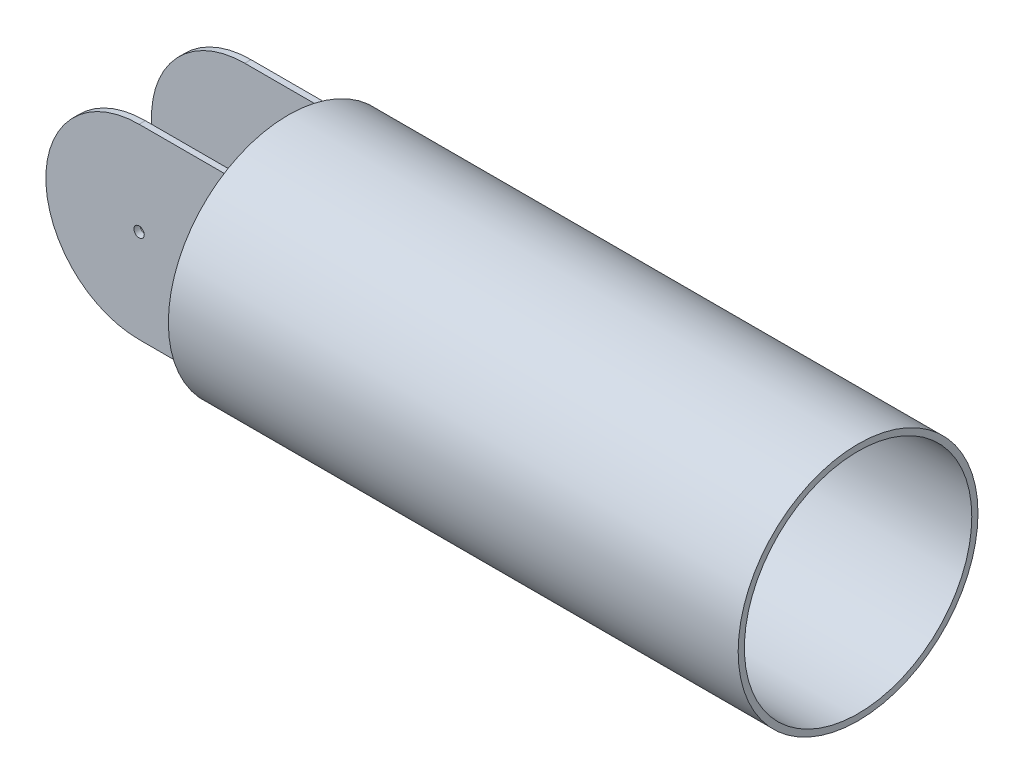
ISO-10303-21;
HEADER;
FILE_DESCRIPTION(('STEP AP214'),'2;1');
FILE_NAME('part.step','',(''),(''),'','','');
FILE_SCHEMA(('AUTOMOTIVE_DESIGN { 1 0 10303 214 1 1 1 1 }'));
ENDSEC;
DATA;
#1=APPLICATION_CONTEXT('core data for automotive mechanical design processes');
#2=APPLICATION_PROTOCOL_DEFINITION('international standard','automotive_design',2000,#1);
#3=PRODUCT_CONTEXT('',#1,'mechanical');
#4=PRODUCT('Part','Part','',(#3));
#5=PRODUCT_RELATED_PRODUCT_CATEGORY('part','',(#4));
#6=PRODUCT_DEFINITION_FORMATION('','',#4);
#7=PRODUCT_DEFINITION_CONTEXT('part definition',#1,'design');
#8=PRODUCT_DEFINITION('design','',#6,#7);
#9=PRODUCT_DEFINITION_SHAPE('','',#8);
#10=(LENGTH_UNIT() NAMED_UNIT(*) SI_UNIT(.MILLI.,.METRE.));
#11=(NAMED_UNIT(*) PLANE_ANGLE_UNIT() SI_UNIT($,.RADIAN.));
#12=(NAMED_UNIT(*) SI_UNIT($,.STERADIAN.) SOLID_ANGLE_UNIT());
#13=UNCERTAINTY_MEASURE_WITH_UNIT(LENGTH_MEASURE(1.E-05),#10,'distance_accuracy_value','');
#14=(GEOMETRIC_REPRESENTATION_CONTEXT(3) GLOBAL_UNCERTAINTY_ASSIGNED_CONTEXT((#13)) GLOBAL_UNIT_ASSIGNED_CONTEXT((#10,
#11,#12)) REPRESENTATION_CONTEXT('',''));
#15=CARTESIAN_POINT('',(0.,0.,0.));
#16=DIRECTION('',(0.,0.,1.));
#17=DIRECTION('',(1.,0.,0.));
#18=AXIS2_PLACEMENT_3D('',#15,#16,#17);
#19=CARTESIAN_POINT('',(0.,0.,108.));
#20=DIRECTION('',(0.,1.,0.));
#21=DIRECTION('',(0.,0.,1.));
#22=AXIS2_PLACEMENT_3D('',#19,#20,#21);
#23=PLANE('',#22);
#24=DIRECTION('',(0.,0.,1.));
#25=VECTOR('',#24,1.);
#26=CARTESIAN_POINT('',(90.,0.,0.));
#27=LINE('',#26,#25);
#28=CARTESIAN_POINT('',(90.,0.,102.));
#29=VERTEX_POINT('',#28);
#30=CARTESIAN_POINT('',(90.,0.,108.));
#31=VERTEX_POINT('',#30);
#32=EDGE_CURVE('E150',#29,#31,#27,.T.);
#33=ORIENTED_EDGE('',*,*,#32,.F.);
#34=DIRECTION('',(1.,0.,0.));
#35=VECTOR('',#34,1.);
#36=CARTESIAN_POINT('',(0.,0.,102.));
#37=LINE('',#36,#35);
#38=CARTESIAN_POINT('',(180.,0.,102.));
#39=VERTEX_POINT('',#38);
#40=EDGE_CURVE('E161',#29,#39,#37,.T.);
#41=ORIENTED_EDGE('',*,*,#40,.T.);
#42=DIRECTION('',(0.,0.,-1.));
#43=VECTOR('',#42,1.);
#44=CARTESIAN_POINT('',(180.,0.,108.));
#45=LINE('',#44,#43);
#46=CARTESIAN_POINT('',(180.,0.,108.));
#47=VERTEX_POINT('',#46);
#48=EDGE_CURVE('E11',#47,#39,#45,.T.);
#49=ORIENTED_EDGE('',*,*,#48,.F.);
#50=DIRECTION('',(1.,0.,0.));
#51=VECTOR('',#50,1.);
#52=CARTESIAN_POINT('',(0.,0.,108.));
#53=LINE('',#52,#51);
#54=EDGE_CURVE('E131',#31,#47,#53,.T.);
#55=ORIENTED_EDGE('',*,*,#54,.F.);
#56=EDGE_LOOP('',(#33,#41,#49,#55));
#57=FACE_BOUND('',#56,.T.);
#58=ADVANCED_FACE('F33',(#57),#23,.F.);
#59=CARTESIAN_POINT('',(0.,180.,108.));
#60=DIRECTION('',(0.,-1.,0.));
#61=DIRECTION('',(0.,0.,-1.));
#62=AXIS2_PLACEMENT_3D('',#59,#60,#61);
#63=PLANE('',#62);
#64=DIRECTION('',(0.,0.,-1.));
#65=VECTOR('',#64,1.);
#66=CARTESIAN_POINT('',(180.,180.,108.));
#67=LINE('',#66,#65);
#68=CARTESIAN_POINT('',(180.,180.,108.));
#69=VERTEX_POINT('',#68);
#70=CARTESIAN_POINT('',(180.,180.,102.));
#71=VERTEX_POINT('',#70);
#72=EDGE_CURVE('E121',#69,#71,#67,.T.);
#73=ORIENTED_EDGE('',*,*,#72,.T.);
#74=DIRECTION('',(1.,0.,0.));
#75=VECTOR('',#74,1.);
#76=CARTESIAN_POINT('',(180.,180.,102.));
#77=LINE('',#76,#75);
#78=CARTESIAN_POINT('',(90.,180.,102.));
#79=VERTEX_POINT('',#78);
#80=EDGE_CURVE('E107',#79,#71,#77,.T.);
#81=ORIENTED_EDGE('',*,*,#80,.F.);
#82=DIRECTION('',(0.,0.,1.));
#83=VECTOR('',#82,1.);
#84=CARTESIAN_POINT('',(90.,180.,0.));
#85=LINE('',#84,#83);
#86=CARTESIAN_POINT('',(90.,180.,108.));
#87=VERTEX_POINT('',#86);
#88=EDGE_CURVE('E141',#79,#87,#85,.T.);
#89=ORIENTED_EDGE('',*,*,#88,.T.);
#90=DIRECTION('',(-1.,0.,0.));
#91=VECTOR('',#90,1.);
#92=CARTESIAN_POINT('',(0.,180.,108.));
#93=LINE('',#92,#91);
#94=EDGE_CURVE('E122',#69,#87,#93,.T.);
#95=ORIENTED_EDGE('',*,*,#94,.F.);
#96=EDGE_LOOP('',(#73,#81,#89,#95));
#97=FACE_BOUND('',#96,.T.);
#98=ADVANCED_FACE('F199',(#97),#63,.F.);
#99=CARTESIAN_POINT('',(90.,90.,0.));
#100=DIRECTION('',(0.,0.,1.));
#101=DIRECTION('',(1.,0.,0.));
#102=AXIS2_PLACEMENT_3D('',#99,#100,#101);
#103=CYLINDRICAL_SURFACE('',#102,90.);
#104=CARTESIAN_POINT('',(90.,90.,102.));
#105=DIRECTION('',(0.,0.,1.));
#106=DIRECTION('',(1.,0.,0.));
#107=AXIS2_PLACEMENT_3D('',#104,#105,#106);
#108=CIRCLE('',#107,90.);
#109=EDGE_CURVE('E166',#29,#79,#108,.F.);
#110=ORIENTED_EDGE('',*,*,#109,.F.);
#111=ORIENTED_EDGE('',*,*,#32,.T.);
#112=CARTESIAN_POINT('',(90.,90.,108.));
#113=DIRECTION('',(0.,0.,1.));
#114=DIRECTION('',(1.,0.,0.));
#115=AXIS2_PLACEMENT_3D('',#112,#113,#114);
#116=CIRCLE('',#115,90.);
#117=EDGE_CURVE('E142',#87,#31,#116,.T.);
#118=ORIENTED_EDGE('',*,*,#117,.F.);
#119=ORIENTED_EDGE('',*,*,#88,.F.);
#120=EDGE_LOOP('',(#110,#111,#118,#119));
#121=FACE_BOUND('',#120,.T.);
#122=ADVANCED_FACE('F204',(#121),#103,.T.);
#123=CARTESIAN_POINT('',(0.,0.,108.));
#124=DIRECTION('',(0.,0.,-1.));
#125=DIRECTION('',(-1.,0.,0.));
#126=AXIS2_PLACEMENT_3D('',#123,#124,#125);
#127=PLANE('',#126);
#128=CARTESIAN_POINT('',(90.,90.,108.));
#129=DIRECTION('',(0.,0.,1.));
#130=DIRECTION('',(1.,0.,0.));
#131=AXIS2_PLACEMENT_3D('',#128,#129,#130);
#132=CIRCLE('',#131,5.00000000000001);
#133=CARTESIAN_POINT('',(95.,90.,108.));
#134=VERTEX_POINT('',#133);
#135=EDGE_CURVE('E178',#134,#134,#132,.T.);
#136=ORIENTED_EDGE('',*,*,#135,.F.);
#137=EDGE_LOOP('',(#136));
#138=FACE_BOUND('',#137,.T.);
#139=ORIENTED_EDGE('',*,*,#117,.T.);
#140=ORIENTED_EDGE('',*,*,#54,.T.);
#141=DIRECTION('',(0.,1.,0.));
#142=VECTOR('',#141,1.);
#143=CARTESIAN_POINT('',(180.,0.,108.));
#144=LINE('',#143,#142);
#145=EDGE_CURVE('E126',#47,#69,#144,.T.);
#146=ORIENTED_EDGE('',*,*,#145,.T.);
#147=ORIENTED_EDGE('',*,*,#94,.T.);
#148=EDGE_LOOP('',(#139,#140,#146,#147));
#149=FACE_BOUND('',#148,.T.);
#150=ADVANCED_FACE('F215',(#138,#149),#127,.F.);
#151=CARTESIAN_POINT('',(0.,0.,0.));
#152=DIRECTION('',(0.,0.,-1.));
#153=DIRECTION('',(-1.,0.,0.));
#154=AXIS2_PLACEMENT_3D('',#151,#152,#153);
#155=PLANE('',#154);
#156=CARTESIAN_POINT('',(90.,90.,0.));
#157=DIRECTION('',(0.,0.,-1.));
#158=DIRECTION('',(-1.,0.,0.));
#159=AXIS2_PLACEMENT_3D('',#156,#157,#158);
#160=CIRCLE('',#159,5.00000000000001);
#161=CARTESIAN_POINT('',(85.,90.,0.));
#162=VERTEX_POINT('',#161);
#163=EDGE_CURVE('E114',#162,#162,#160,.T.);
#164=ORIENTED_EDGE('',*,*,#163,.F.);
#165=EDGE_LOOP('',(#164));
#166=FACE_BOUND('',#165,.T.);
#167=DIRECTION('',(1.,0.,0.));
#168=VECTOR('',#167,1.);
#169=CARTESIAN_POINT('',(0.,0.,0.));
#170=LINE('',#169,#168);
#171=CARTESIAN_POINT('',(90.,0.,0.));
#172=VERTEX_POINT('',#171);
#173=CARTESIAN_POINT('',(180.,0.,0.));
#174=VERTEX_POINT('',#173);
#175=EDGE_CURVE('E133',#172,#174,#170,.T.);
#176=ORIENTED_EDGE('',*,*,#175,.F.);
#177=CARTESIAN_POINT('',(90.,90.,0.));
#178=DIRECTION('',(0.,0.,1.));
#179=DIRECTION('',(1.,0.,0.));
#180=AXIS2_PLACEMENT_3D('',#177,#178,#179);
#181=CIRCLE('',#180,90.);
#182=CARTESIAN_POINT('',(90.,180.,0.));
#183=VERTEX_POINT('',#182);
#184=EDGE_CURVE('E145',#183,#172,#181,.T.);
#185=ORIENTED_EDGE('',*,*,#184,.F.);
#186=DIRECTION('',(-1.,0.,0.));
#187=VECTOR('',#186,1.);
#188=CARTESIAN_POINT('',(0.,180.,0.));
#189=LINE('',#188,#187);
#190=CARTESIAN_POINT('',(180.,180.,0.));
#191=VERTEX_POINT('',#190);
#192=EDGE_CURVE('E129',#191,#183,#189,.T.);
#193=ORIENTED_EDGE('',*,*,#192,.F.);
#194=DIRECTION('',(0.,1.,0.));
#195=VECTOR('',#194,1.);
#196=CARTESIAN_POINT('',(180.,0.,0.));
#197=LINE('',#196,#195);
#198=EDGE_CURVE('E119',#174,#191,#197,.T.);
#199=ORIENTED_EDGE('',*,*,#198,.F.);
#200=EDGE_LOOP('',(#176,#185,#193,#199));
#201=FACE_BOUND('',#200,.T.);
#202=ADVANCED_FACE('F208',(#166,#201),#155,.T.);
#203=CARTESIAN_POINT('',(180.,0.,6.));
#204=VERTEX_POINT('',#203);
#205=EDGE_CURVE('E42',#204,#174,#45,.T.);
#206=ORIENTED_EDGE('',*,*,#205,.F.);
#207=DIRECTION('',(-1.,0.,0.));
#208=VECTOR('',#207,1.);
#209=CARTESIAN_POINT('',(0.,0.,6.00000000000002));
#210=LINE('',#209,#208);
#211=CARTESIAN_POINT('',(90.,0.,6.00000000000001));
#212=VERTEX_POINT('',#211);
#213=EDGE_CURVE('E103',#204,#212,#210,.T.);
#214=ORIENTED_EDGE('',*,*,#213,.T.);
#215=EDGE_CURVE('E146',#172,#212,#27,.T.);
#216=ORIENTED_EDGE('',*,*,#215,.F.);
#217=ORIENTED_EDGE('',*,*,#175,.T.);
#218=EDGE_LOOP('',(#206,#214,#216,#217));
#219=FACE_BOUND('',#218,.T.);
#220=ADVANCED_FACE('F35',(#219),#23,.F.);
#221=CARTESIAN_POINT('',(90.,180.,6.00000000000001));
#222=VERTEX_POINT('',#221);
#223=EDGE_CURVE('E56',#183,#222,#85,.T.);
#224=ORIENTED_EDGE('',*,*,#223,.T.);
#225=DIRECTION('',(-1.,0.,0.));
#226=VECTOR('',#225,1.);
#227=CARTESIAN_POINT('',(180.,180.,6.));
#228=LINE('',#227,#226);
#229=CARTESIAN_POINT('',(180.,180.,6.));
#230=VERTEX_POINT('',#229);
#231=EDGE_CURVE('E101',#230,#222,#228,.T.);
#232=ORIENTED_EDGE('',*,*,#231,.F.);
#233=EDGE_CURVE('E112',#230,#191,#67,.T.);
#234=ORIENTED_EDGE('',*,*,#233,.T.);
#235=ORIENTED_EDGE('',*,*,#192,.T.);
#236=EDGE_LOOP('',(#224,#232,#234,#235));
#237=FACE_BOUND('',#236,.T.);
#238=ADVANCED_FACE('F110',(#237),#63,.F.);
#239=ORIENTED_EDGE('',*,*,#215,.T.);
#240=CARTESIAN_POINT('',(90.,90.,6.00000000000001));
#241=DIRECTION('',(0.,0.,-1.));
#242=DIRECTION('',(-1.,0.,0.));
#243=AXIS2_PLACEMENT_3D('',#240,#241,#242);
#244=CIRCLE('',#243,90.);
#245=EDGE_CURVE('E169',#222,#212,#244,.F.);
#246=ORIENTED_EDGE('',*,*,#245,.F.);
#247=ORIENTED_EDGE('',*,*,#223,.F.);
#248=ORIENTED_EDGE('',*,*,#184,.T.);
#249=EDGE_LOOP('',(#239,#246,#247,#248));
#250=FACE_BOUND('',#249,.T.);
#251=ADVANCED_FACE('F214',(#250),#103,.T.);
#252=CARTESIAN_POINT('',(180.,90.,54.));
#253=DIRECTION('',(1.,0.,0.));
#254=DIRECTION('',(0.,0.,-1.));
#255=AXIS2_PLACEMENT_3D('',#252,#253,#254);
#256=PLANE('',#255);
#257=DIRECTION('',(0.,1.,0.));
#258=VECTOR('',#257,1.);
#259=CARTESIAN_POINT('',(180.,-114.,6.));
#260=LINE('',#259,#258);
#261=EDGE_CURVE('E98',#204,#230,#260,.T.);
#262=ORIENTED_EDGE('',*,*,#261,.F.);
#263=ORIENTED_EDGE('',*,*,#205,.T.);
#264=ORIENTED_EDGE('',*,*,#198,.T.);
#265=ORIENTED_EDGE('',*,*,#233,.F.);
#266=EDGE_LOOP('',(#262,#263,#264,#265));
#267=FACE_BOUND('',#266,.T.);
#268=CARTESIAN_POINT('',(180.,90.,54.));
#269=DIRECTION('',(1.,0.,0.));
#270=DIRECTION('',(0.,0.,-1.));
#271=AXIS2_PLACEMENT_3D('',#268,#269,#270);
#272=CIRCLE('',#271,115.75);
#273=CARTESIAN_POINT('',(180.,90.,-61.75));
#274=VERTEX_POINT('',#273);
#275=EDGE_CURVE('E151',#274,#274,#272,.T.);
#276=ORIENTED_EDGE('',*,*,#275,.F.);
#277=EDGE_LOOP('',(#276));
#278=FACE_BOUND('',#277,.T.);
#279=ORIENTED_EDGE('',*,*,#48,.T.);
#280=DIRECTION('',(0.,1.,0.));
#281=VECTOR('',#280,1.);
#282=CARTESIAN_POINT('',(180.,-114.,102.));
#283=LINE('',#282,#281);
#284=EDGE_CURVE('E48',#39,#71,#283,.T.);
#285=ORIENTED_EDGE('',*,*,#284,.T.);
#286=ORIENTED_EDGE('',*,*,#72,.F.);
#287=ORIENTED_EDGE('',*,*,#145,.F.);
#288=EDGE_LOOP('',(#279,#285,#286,#287));
#289=FACE_BOUND('',#288,.T.);
#290=ADVANCED_FACE('F116',(#267,#278,#289),#256,.F.);
#291=CARTESIAN_POINT('',(730.,90.,54.));
#292=DIRECTION('',(-1.,0.,0.));
#293=DIRECTION('',(0.,0.,1.));
#294=AXIS2_PLACEMENT_3D('',#291,#292,#293);
#295=CYLINDRICAL_SURFACE('',#294,115.75);
#296=CARTESIAN_POINT('',(730.,90.,54.));
#297=DIRECTION('',(1.,0.,0.));
#298=DIRECTION('',(0.,0.,-1.));
#299=AXIS2_PLACEMENT_3D('',#296,#297,#298);
#300=CIRCLE('',#299,115.75);
#301=CARTESIAN_POINT('',(730.,90.,-61.75));
#302=VERTEX_POINT('',#301);
#303=EDGE_CURVE('E154',#302,#302,#300,.T.);
#304=ORIENTED_EDGE('',*,*,#303,.F.);
#305=EDGE_LOOP('',(#304));
#306=FACE_BOUND('',#305,.T.);
#307=ORIENTED_EDGE('',*,*,#275,.T.);
#308=EDGE_LOOP('',(#307));
#309=FACE_BOUND('',#308,.T.);
#310=ADVANCED_FACE('F226',(#306,#309),#295,.T.);
#311=CARTESIAN_POINT('',(730.,90.,54.));
#312=DIRECTION('',(1.,0.,0.));
#313=DIRECTION('',(0.,0.,-1.));
#314=AXIS2_PLACEMENT_3D('',#311,#312,#313);
#315=PLANE('',#314);
#316=CARTESIAN_POINT('',(730.,90.,54.));
#317=DIRECTION('',(1.,0.,0.));
#318=DIRECTION('',(0.,0.,-1.));
#319=AXIS2_PLACEMENT_3D('',#316,#317,#318);
#320=CIRCLE('',#319,109.75);
#321=CARTESIAN_POINT('',(730.,90.,-55.75));
#322=VERTEX_POINT('',#321);
#323=EDGE_CURVE('E158',#322,#322,#320,.T.);
#324=ORIENTED_EDGE('',*,*,#323,.F.);
#325=EDGE_LOOP('',(#324));
#326=FACE_BOUND('',#325,.T.);
#327=ORIENTED_EDGE('',*,*,#303,.T.);
#328=EDGE_LOOP('',(#327));
#329=FACE_BOUND('',#328,.T.);
#330=ADVANCED_FACE('F257',(#326,#329),#315,.T.);
#331=CARTESIAN_POINT('',(436.,90.,54.));
#332=DIRECTION('',(1.,0.,0.));
#333=DIRECTION('',(0.,0.,-1.));
#334=AXIS2_PLACEMENT_3D('',#331,#332,#333);
#335=CYLINDRICAL_SURFACE('',#334,109.75);
#336=CARTESIAN_POINT('',(436.,90.,54.));
#337=DIRECTION('',(1.,0.,0.));
#338=DIRECTION('',(0.,0.,-1.));
#339=AXIS2_PLACEMENT_3D('',#336,#337,#338);
#340=CIRCLE('',#339,109.75);
#341=CARTESIAN_POINT('',(436.,90.,-55.75));
#342=VERTEX_POINT('',#341);
#343=EDGE_CURVE('E155',#342,#342,#340,.T.);
#344=ORIENTED_EDGE('',*,*,#343,.F.);
#345=EDGE_LOOP('',(#344));
#346=FACE_BOUND('',#345,.T.);
#347=ORIENTED_EDGE('',*,*,#323,.T.);
#348=EDGE_LOOP('',(#347));
#349=FACE_BOUND('',#348,.T.);
#350=ADVANCED_FACE('F251',(#346,#349),#335,.F.);
#351=CARTESIAN_POINT('',(436.,90.,54.));
#352=DIRECTION('',(1.,0.,0.));
#353=DIRECTION('',(0.,0.,-1.));
#354=AXIS2_PLACEMENT_3D('',#351,#352,#353);
#355=PLANE('',#354);
#356=ORIENTED_EDGE('',*,*,#343,.T.);
#357=EDGE_LOOP('',(#356));
#358=FACE_BOUND('',#357,.T.);
#359=ADVANCED_FACE('F246',(#358),#355,.T.);
#360=CARTESIAN_POINT('',(180.,-114.,102.));
#361=DIRECTION('',(0.,0.,1.));
#362=DIRECTION('',(1.,0.,0.));
#363=AXIS2_PLACEMENT_3D('',#360,#361,#362);
#364=PLANE('',#363);
#365=CARTESIAN_POINT('',(90.,90.,102.));
#366=DIRECTION('',(0.,0.,1.));
#367=DIRECTION('',(1.,0.,0.));
#368=AXIS2_PLACEMENT_3D('',#365,#366,#367);
#369=CIRCLE('',#368,5.00000000000001);
#370=CARTESIAN_POINT('',(95.,90.,102.));
#371=VERTEX_POINT('',#370);
#372=EDGE_CURVE('E175',#371,#371,#369,.T.);
#373=ORIENTED_EDGE('',*,*,#372,.T.);
#374=EDGE_LOOP('',(#373));
#375=FACE_BOUND('',#374,.T.);
#376=ORIENTED_EDGE('',*,*,#40,.F.);
#377=ORIENTED_EDGE('',*,*,#109,.T.);
#378=ORIENTED_EDGE('',*,*,#80,.T.);
#379=ORIENTED_EDGE('',*,*,#284,.F.);
#380=EDGE_LOOP('',(#376,#377,#378,#379));
#381=FACE_BOUND('',#380,.T.);
#382=ADVANCED_FACE('F195',(#375,#381),#364,.F.);
#383=CARTESIAN_POINT('',(180.,-114.,6.));
#384=DIRECTION('',(0.,0.,-1.));
#385=DIRECTION('',(-1.,0.,0.));
#386=AXIS2_PLACEMENT_3D('',#383,#384,#385);
#387=PLANE('',#386);
#388=CARTESIAN_POINT('',(90.,90.,6.00000000000001));
#389=DIRECTION('',(0.,0.,-1.));
#390=DIRECTION('',(-1.,0.,0.));
#391=AXIS2_PLACEMENT_3D('',#388,#389,#390);
#392=CIRCLE('',#391,5.00000000000001);
#393=CARTESIAN_POINT('',(85.,90.,6.00000000000001));
#394=VERTEX_POINT('',#393);
#395=EDGE_CURVE('E37',#394,#394,#392,.T.);
#396=ORIENTED_EDGE('',*,*,#395,.T.);
#397=EDGE_LOOP('',(#396));
#398=FACE_BOUND('',#397,.T.);
#399=ORIENTED_EDGE('',*,*,#261,.T.);
#400=ORIENTED_EDGE('',*,*,#231,.T.);
#401=ORIENTED_EDGE('',*,*,#245,.T.);
#402=ORIENTED_EDGE('',*,*,#213,.F.);
#403=EDGE_LOOP('',(#399,#400,#401,#402));
#404=FACE_BOUND('',#403,.T.);
#405=ADVANCED_FACE('F100',(#398,#404),#387,.F.);
#406=CARTESIAN_POINT('',(90.,90.,-186.));
#407=DIRECTION('',(0.,0.,1.));
#408=DIRECTION('',(1.,0.,0.));
#409=AXIS2_PLACEMENT_3D('',#406,#407,#408);
#410=CYLINDRICAL_SURFACE('',#409,5.00000000000001);
#411=ORIENTED_EDGE('',*,*,#163,.T.);
#412=EDGE_LOOP('',(#411));
#413=FACE_BOUND('',#412,.T.);
#414=ORIENTED_EDGE('',*,*,#395,.F.);
#415=EDGE_LOOP('',(#414));
#416=FACE_BOUND('',#415,.T.);
#417=ADVANCED_FACE('F186',(#413,#416),#410,.F.);
#418=ORIENTED_EDGE('',*,*,#135,.T.);
#419=EDGE_LOOP('',(#418));
#420=FACE_BOUND('',#419,.T.);
#421=ORIENTED_EDGE('',*,*,#372,.F.);
#422=EDGE_LOOP('',(#421));
#423=FACE_BOUND('',#422,.T.);
#424=ADVANCED_FACE('F188',(#420,#423),#410,.F.);
#425=CLOSED_SHELL('',(#58,#98,#122,#150,#202,#220,#238,#251,#290,#310,#330,#350,#359,#382,#405,
#417,#424));
#426=MANIFOLD_SOLID_BREP('B2',#425);
#427=ADVANCED_BREP_SHAPE_REPRESENTATION('',(#18,#426),#14);
#428=SHAPE_DEFINITION_REPRESENTATION(#9,#427);
ENDSEC;
END-ISO-10303-21;
